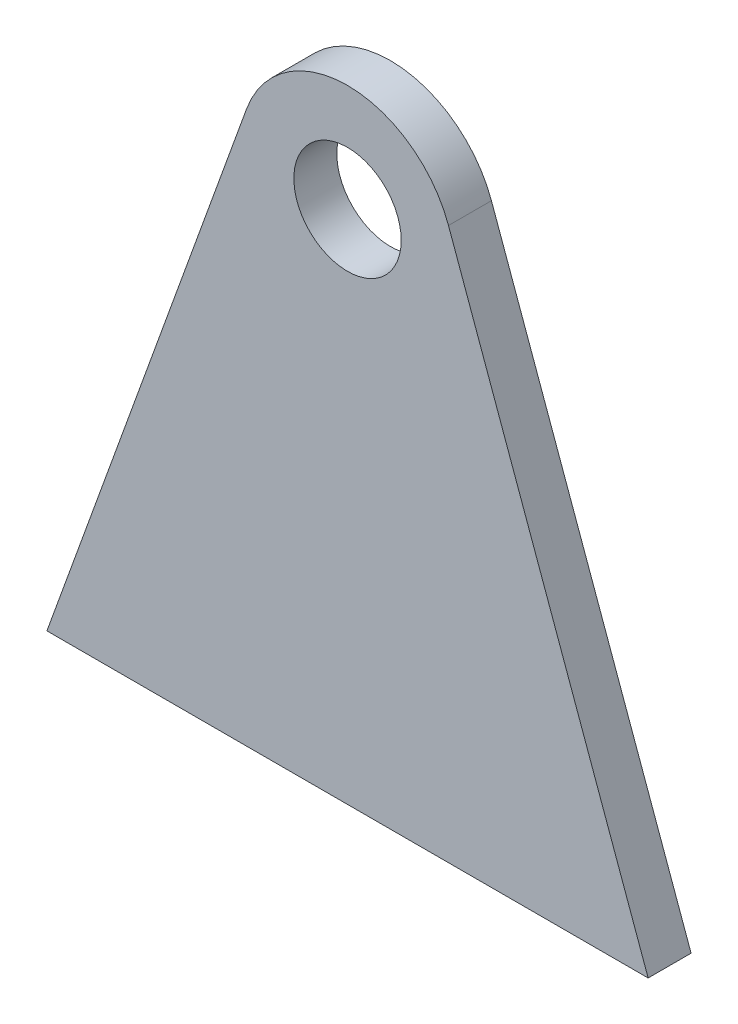
ISO-10303-21;
HEADER;
FILE_DESCRIPTION(('STEP AP214'),'2;1');
FILE_NAME('part.step','',(''),(''),'','','');
FILE_SCHEMA(('AUTOMOTIVE_DESIGN { 1 0 10303 214 1 1 1 1 }'));
ENDSEC;
DATA;
#1=APPLICATION_CONTEXT('core data for automotive mechanical design processes');
#2=APPLICATION_PROTOCOL_DEFINITION('international standard','automotive_design',2000,#1);
#3=PRODUCT_CONTEXT('',#1,'mechanical');
#4=PRODUCT('Part','Part','',(#3));
#5=PRODUCT_RELATED_PRODUCT_CATEGORY('part','',(#4));
#6=PRODUCT_DEFINITION_FORMATION('','',#4);
#7=PRODUCT_DEFINITION_CONTEXT('part definition',#1,'design');
#8=PRODUCT_DEFINITION('design','',#6,#7);
#9=PRODUCT_DEFINITION_SHAPE('','',#8);
#10=(LENGTH_UNIT() NAMED_UNIT(*) SI_UNIT(.MILLI.,.METRE.));
#11=(NAMED_UNIT(*) PLANE_ANGLE_UNIT() SI_UNIT($,.RADIAN.));
#12=(NAMED_UNIT(*) SI_UNIT($,.STERADIAN.) SOLID_ANGLE_UNIT());
#13=UNCERTAINTY_MEASURE_WITH_UNIT(LENGTH_MEASURE(1.E-05),#10,'distance_accuracy_value','');
#14=(GEOMETRIC_REPRESENTATION_CONTEXT(3) GLOBAL_UNCERTAINTY_ASSIGNED_CONTEXT((#13)) GLOBAL_UNIT_ASSIGNED_CONTEXT((#10,
#11,#12)) REPRESENTATION_CONTEXT('',''));
#15=CARTESIAN_POINT('',(0.,0.,0.));
#16=DIRECTION('',(0.,0.,1.));
#17=DIRECTION('',(1.,0.,0.));
#18=AXIS2_PLACEMENT_3D('',#15,#16,#17);
#19=CARTESIAN_POINT('',(0.,0.,10.));
#20=DIRECTION('',(0.,0.,1.));
#21=DIRECTION('',(1.,0.,0.));
#22=AXIS2_PLACEMENT_3D('',#19,#20,#21);
#23=PLANE('',#22);
#24=CARTESIAN_POINT('',(0.,0.,10.));
#25=DIRECTION('',(0.,0.,1.));
#26=DIRECTION('',(1.,0.,0.));
#27=AXIS2_PLACEMENT_3D('',#24,#25,#26);
#28=CIRCLE('',#27,50.);
#29=CARTESIAN_POINT('',(47.0175659131081,17.0102467826464,10.));
#30=VERTEX_POINT('',#29);
#31=CARTESIAN_POINT('',(-47.0175659131082,17.0102467826464,10.));
#32=VERTEX_POINT('',#31);
#33=EDGE_CURVE('E85',#30,#32,#28,.T.);
#34=ORIENTED_EDGE('',*,*,#33,.T.);
#35=DIRECTION('',(-0.340204935652928,-0.940351318262163,0.));
#36=VECTOR('',#35,1.);
#37=CARTESIAN_POINT('',(-140.,-240.,10.));
#38=LINE('',#37,#36);
#39=CARTESIAN_POINT('',(-140.,-240.,10.));
#40=VERTEX_POINT('',#39);
#41=EDGE_CURVE('E80',#32,#40,#38,.T.);
#42=ORIENTED_EDGE('',*,*,#41,.T.);
#43=DIRECTION('',(1.,0.,0.));
#44=VECTOR('',#43,1.);
#45=CARTESIAN_POINT('',(-140.,-240.,10.));
#46=LINE('',#45,#44);
#47=CARTESIAN_POINT('',(140.,-240.,10.));
#48=VERTEX_POINT('',#47);
#49=EDGE_CURVE('E83',#40,#48,#46,.T.);
#50=ORIENTED_EDGE('',*,*,#49,.T.);
#51=DIRECTION('',(-0.340204935652929,0.940351318262163,0.));
#52=VECTOR('',#51,1.);
#53=CARTESIAN_POINT('',(140.,-240.,10.));
#54=LINE('',#53,#52);
#55=EDGE_CURVE('E50',#48,#30,#54,.T.);
#56=ORIENTED_EDGE('',*,*,#55,.T.);
#57=EDGE_LOOP('',(#34,#42,#50,#56));
#58=FACE_BOUND('',#57,.T.);
#59=CARTESIAN_POINT('',(0.,0.,10.));
#60=DIRECTION('',(0.,0.,1.));
#61=DIRECTION('',(1.,0.,0.));
#62=AXIS2_PLACEMENT_3D('',#59,#60,#61);
#63=CIRCLE('',#62,25.);
#64=CARTESIAN_POINT('',(25.,0.,10.));
#65=VERTEX_POINT('',#64);
#66=EDGE_CURVE('E100',#65,#65,#63,.T.);
#67=ORIENTED_EDGE('',*,*,#66,.F.);
#68=EDGE_LOOP('',(#67));
#69=FACE_BOUND('',#68,.T.);
#70=ADVANCED_FACE('F33',(#58,#69),#23,.T.);
#71=CARTESIAN_POINT('',(0.,0.,-10.));
#72=DIRECTION('',(0.,0.,1.));
#73=DIRECTION('',(1.,0.,0.));
#74=AXIS2_PLACEMENT_3D('',#71,#72,#73);
#75=PLANE('',#74);
#76=CARTESIAN_POINT('',(0.,0.,-10.));
#77=DIRECTION('',(0.,0.,1.));
#78=DIRECTION('',(1.,0.,0.));
#79=AXIS2_PLACEMENT_3D('',#76,#77,#78);
#80=CIRCLE('',#79,50.);
#81=CARTESIAN_POINT('',(47.0175659131081,17.0102467826464,-10.));
#82=VERTEX_POINT('',#81);
#83=CARTESIAN_POINT('',(-47.0175659131082,17.0102467826464,-10.));
#84=VERTEX_POINT('',#83);
#85=EDGE_CURVE('E97',#82,#84,#80,.T.);
#86=ORIENTED_EDGE('',*,*,#85,.F.);
#87=DIRECTION('',(-0.340204935652929,0.940351318262163,0.));
#88=VECTOR('',#87,1.);
#89=CARTESIAN_POINT('',(140.,-240.,-10.));
#90=LINE('',#89,#88);
#91=CARTESIAN_POINT('',(140.,-240.,-10.));
#92=VERTEX_POINT('',#91);
#93=EDGE_CURVE('E73',#92,#82,#90,.T.);
#94=ORIENTED_EDGE('',*,*,#93,.F.);
#95=DIRECTION('',(1.,0.,0.));
#96=VECTOR('',#95,1.);
#97=CARTESIAN_POINT('',(-140.,-240.,-10.));
#98=LINE('',#97,#96);
#99=CARTESIAN_POINT('',(-140.,-240.,-10.));
#100=VERTEX_POINT('',#99);
#101=EDGE_CURVE('E67',#100,#92,#98,.T.);
#102=ORIENTED_EDGE('',*,*,#101,.F.);
#103=DIRECTION('',(-0.340204935652928,-0.940351318262163,0.));
#104=VECTOR('',#103,1.);
#105=CARTESIAN_POINT('',(-140.,-240.,-10.));
#106=LINE('',#105,#104);
#107=EDGE_CURVE('E89',#84,#100,#106,.T.);
#108=ORIENTED_EDGE('',*,*,#107,.F.);
#109=EDGE_LOOP('',(#86,#94,#102,#108));
#110=FACE_BOUND('',#109,.T.);
#111=CARTESIAN_POINT('',(0.,0.,-10.));
#112=DIRECTION('',(0.,0.,1.));
#113=DIRECTION('',(1.,0.,0.));
#114=AXIS2_PLACEMENT_3D('',#111,#112,#113);
#115=CIRCLE('',#114,25.);
#116=CARTESIAN_POINT('',(25.,0.,-10.));
#117=VERTEX_POINT('',#116);
#118=EDGE_CURVE('E112',#117,#117,#115,.T.);
#119=ORIENTED_EDGE('',*,*,#118,.T.);
#120=EDGE_LOOP('',(#119));
#121=FACE_BOUND('',#120,.T.);
#122=ADVANCED_FACE('F108',(#110,#121),#75,.F.);
#123=CARTESIAN_POINT('',(0.,0.,10.));
#124=DIRECTION('',(0.,0.,-1.));
#125=DIRECTION('',(-1.,0.,0.));
#126=AXIS2_PLACEMENT_3D('',#123,#124,#125);
#127=CYLINDRICAL_SURFACE('',#126,50.);
#128=ORIENTED_EDGE('',*,*,#85,.T.);
#129=DIRECTION('',(0.,0.,-1.));
#130=VECTOR('',#129,1.);
#131=CARTESIAN_POINT('',(-47.0175659131082,17.0102467826464,10.));
#132=LINE('',#131,#130);
#133=EDGE_CURVE('E11',#32,#84,#132,.T.);
#134=ORIENTED_EDGE('',*,*,#133,.F.);
#135=ORIENTED_EDGE('',*,*,#33,.F.);
#136=DIRECTION('',(0.,0.,-1.));
#137=VECTOR('',#136,1.);
#138=CARTESIAN_POINT('',(47.0175659131081,17.0102467826464,10.));
#139=LINE('',#138,#137);
#140=EDGE_CURVE('E93',#30,#82,#139,.T.);
#141=ORIENTED_EDGE('',*,*,#140,.T.);
#142=EDGE_LOOP('',(#128,#134,#135,#141));
#143=FACE_BOUND('',#142,.T.);
#144=ADVANCED_FACE('F35',(#143),#127,.T.);
#145=CARTESIAN_POINT('',(-140.,-240.,10.));
#146=DIRECTION('',(0.940351318262163,-0.340204935652928,0.));
#147=DIRECTION('',(0.340204935652928,0.940351318262163,0.));
#148=AXIS2_PLACEMENT_3D('',#145,#146,#147);
#149=PLANE('',#148);
#150=ORIENTED_EDGE('',*,*,#107,.T.);
#151=DIRECTION('',(0.,0.,-1.));
#152=VECTOR('',#151,1.);
#153=CARTESIAN_POINT('',(-140.,-240.,10.));
#154=LINE('',#153,#152);
#155=EDGE_CURVE('E42',#40,#100,#154,.T.);
#156=ORIENTED_EDGE('',*,*,#155,.F.);
#157=ORIENTED_EDGE('',*,*,#41,.F.);
#158=ORIENTED_EDGE('',*,*,#133,.T.);
#159=EDGE_LOOP('',(#150,#156,#157,#158));
#160=FACE_BOUND('',#159,.T.);
#161=ADVANCED_FACE('F88',(#160),#149,.F.);
#162=CARTESIAN_POINT('',(-140.,-240.,10.));
#163=DIRECTION('',(0.,1.,0.));
#164=DIRECTION('',(-1.,0.,0.));
#165=AXIS2_PLACEMENT_3D('',#162,#163,#164);
#166=PLANE('',#165);
#167=ORIENTED_EDGE('',*,*,#101,.T.);
#168=DIRECTION('',(0.,0.,-1.));
#169=VECTOR('',#168,1.);
#170=CARTESIAN_POINT('',(140.,-240.,10.));
#171=LINE('',#170,#169);
#172=EDGE_CURVE('E90',#48,#92,#171,.T.);
#173=ORIENTED_EDGE('',*,*,#172,.F.);
#174=ORIENTED_EDGE('',*,*,#49,.F.);
#175=ORIENTED_EDGE('',*,*,#155,.T.);
#176=EDGE_LOOP('',(#167,#173,#174,#175));
#177=FACE_BOUND('',#176,.T.);
#178=ADVANCED_FACE('F91',(#177),#166,.F.);
#179=CARTESIAN_POINT('',(140.,-240.,10.));
#180=DIRECTION('',(-0.940351318262163,-0.340204935652929,0.));
#181=DIRECTION('',(0.340204935652929,-0.940351318262163,0.));
#182=AXIS2_PLACEMENT_3D('',#179,#180,#181);
#183=PLANE('',#182);
#184=ORIENTED_EDGE('',*,*,#93,.T.);
#185=ORIENTED_EDGE('',*,*,#140,.F.);
#186=ORIENTED_EDGE('',*,*,#55,.F.);
#187=ORIENTED_EDGE('',*,*,#172,.T.);
#188=EDGE_LOOP('',(#184,#185,#186,#187));
#189=FACE_BOUND('',#188,.T.);
#190=ADVANCED_FACE('F105',(#189),#183,.F.);
#191=CARTESIAN_POINT('',(0.,0.,10.));
#192=DIRECTION('',(0.,0.,-1.));
#193=DIRECTION('',(-1.,0.,0.));
#194=AXIS2_PLACEMENT_3D('',#191,#192,#193);
#195=CYLINDRICAL_SURFACE('',#194,25.);
#196=ORIENTED_EDGE('',*,*,#66,.T.);
#197=EDGE_LOOP('',(#196));
#198=FACE_BOUND('',#197,.T.);
#199=ORIENTED_EDGE('',*,*,#118,.F.);
#200=EDGE_LOOP('',(#199));
#201=FACE_BOUND('',#200,.T.);
#202=ADVANCED_FACE('F118',(#198,#201),#195,.F.);
#203=CLOSED_SHELL('',(#70,#122,#144,#161,#178,#190,#202));
#204=MANIFOLD_SOLID_BREP('B2',#203);
#205=ADVANCED_BREP_SHAPE_REPRESENTATION('',(#18,#204),#14);
#206=SHAPE_DEFINITION_REPRESENTATION(#9,#205);
ENDSEC;
END-ISO-10303-21;
